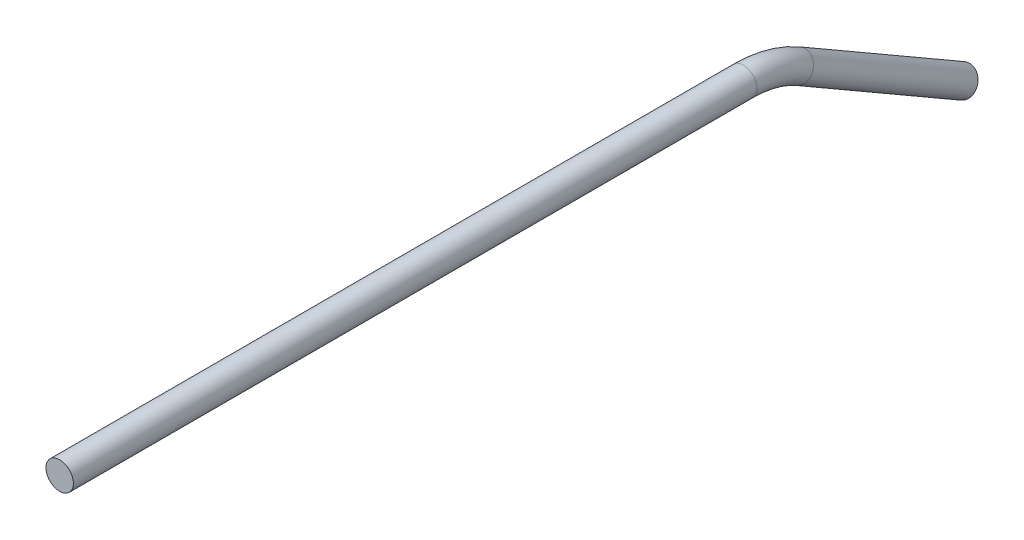
ISO-10303-21;
HEADER;
FILE_DESCRIPTION(('STEP AP214'),'2;1');
FILE_NAME('part.step','',(''),(''),'','','');
FILE_SCHEMA(('AUTOMOTIVE_DESIGN { 1 0 10303 214 1 1 1 1 }'));
ENDSEC;
DATA;
#1=APPLICATION_CONTEXT('core data for automotive mechanical design processes');
#2=APPLICATION_PROTOCOL_DEFINITION('international standard','automotive_design',2000,#1);
#3=PRODUCT_CONTEXT('',#1,'mechanical');
#4=PRODUCT('Part','Part','',(#3));
#5=PRODUCT_RELATED_PRODUCT_CATEGORY('part','',(#4));
#6=PRODUCT_DEFINITION_FORMATION('','',#4);
#7=PRODUCT_DEFINITION_CONTEXT('part definition',#1,'design');
#8=PRODUCT_DEFINITION('design','',#6,#7);
#9=PRODUCT_DEFINITION_SHAPE('','',#8);
#10=(LENGTH_UNIT() NAMED_UNIT(*) SI_UNIT(.MILLI.,.METRE.));
#11=(NAMED_UNIT(*) PLANE_ANGLE_UNIT() SI_UNIT($,.RADIAN.));
#12=(NAMED_UNIT(*) SI_UNIT($,.STERADIAN.) SOLID_ANGLE_UNIT());
#13=UNCERTAINTY_MEASURE_WITH_UNIT(LENGTH_MEASURE(1.E-05),#10,'distance_accuracy_value','');
#14=(GEOMETRIC_REPRESENTATION_CONTEXT(3) GLOBAL_UNCERTAINTY_ASSIGNED_CONTEXT((#13)) GLOBAL_UNIT_ASSIGNED_CONTEXT((#10,
#11,#12)) REPRESENTATION_CONTEXT('',''));
#15=CARTESIAN_POINT('',(0.,0.,0.));
#16=DIRECTION('',(0.,0.,1.));
#17=DIRECTION('',(1.,0.,0.));
#18=AXIS2_PLACEMENT_3D('',#15,#16,#17);
#19=CARTESIAN_POINT('',(0.,-3.40295474387528,-170.994090512249));
#20=DIRECTION('',(0.,-0.500000000000001,-0.866025403784438));
#21=DIRECTION('',(0.,0.866025403784438,-0.500000000000001));
#22=AXIS2_PLACEMENT_3D('',#19,#20,#21);
#23=CYLINDRICAL_SURFACE('',#22,3.175);
#24=CARTESIAN_POINT('',(0.,-3.40295474387528,-170.994090512249));
#25=DIRECTION('',(0.,0.500000000000002,0.866025403784438));
#26=DIRECTION('',(1.,0.,0.));
#27=AXIS2_PLACEMENT_3D('',#24,#25,#26);
#28=CIRCLE('',#27,3.175);
#29=CARTESIAN_POINT('',(0.,-0.653324086859693,-172.58159051225));
#30=VERTEX_POINT('',#29);
#31=EDGE_CURVE('E37',#30,#30,#28,.T.);
#32=ORIENTED_EDGE('',*,*,#31,.F.);
#33=EDGE_LOOP('',(#32));
#34=FACE_BOUND('',#33,.T.);
#35=CARTESIAN_POINT('',(0.,-25.4,-209.094090512249));
#36=DIRECTION('',(0.,0.500000000000002,0.866025403784438));
#37=DIRECTION('',(1.,0.,0.));
#38=AXIS2_PLACEMENT_3D('',#35,#36,#37);
#39=CIRCLE('',#38,3.175);
#40=CARTESIAN_POINT('',(3.175,-25.4,-209.094090512249));
#41=VERTEX_POINT('',#40);
#42=EDGE_CURVE('E10',#41,#41,#39,.T.);
#43=ORIENTED_EDGE('',*,*,#42,.T.);
#44=EDGE_LOOP('',(#43));
#45=FACE_BOUND('',#44,.T.);
#46=ADVANCED_FACE('F31',(#34,#45),#23,.T.);
#47=CARTESIAN_POINT('',(0.,-25.4,-158.294090512249));
#48=DIRECTION('',(-1.,0.,0.));
#49=DIRECTION('',(0.,0.,1.));
#50=AXIS2_PLACEMENT_3D('',#47,#48,#49);
#51=TOROIDAL_SURFACE('',#50,25.4,3.175);
#52=CARTESIAN_POINT('',(0.,0.,-158.294090512249));
#53=DIRECTION('',(0.,0.,1.));
#54=DIRECTION('',(1.,0.,0.));
#55=AXIS2_PLACEMENT_3D('',#52,#53,#54);
#56=CIRCLE('',#55,3.175);
#57=CARTESIAN_POINT('',(0.,3.175,-158.294090512249));
#58=VERTEX_POINT('',#57);
#59=EDGE_CURVE('E41',#58,#58,#56,.T.);
#60=CARTESIAN_POINT('',(0.,-25.4,-158.294090512249));
#61=DIRECTION('',(-1.,0.,0.));
#62=DIRECTION('',(0.,0.,1.));
#63=AXIS2_PLACEMENT_3D('',#60,#61,#62);
#64=CIRCLE('',#63,28.575);
#65=EDGE_CURVE('',#58,#30,#64,.T.);
#66=ORIENTED_EDGE('',*,*,#59,.F.);
#67=ORIENTED_EDGE('',*,*,#31,.T.);
#68=ORIENTED_EDGE('',*,*,#65,.T.);
#69=ORIENTED_EDGE('',*,*,#65,.F.);
#70=EDGE_LOOP('',(#66,#68,#67,#69));
#71=FACE_BOUND('',#70,.T.);
#72=ADVANCED_FACE('F56',(#71),#51,.T.);
#73=CARTESIAN_POINT('',(0.,0.,-158.294090512249));
#74=DIRECTION('',(0.,0.,1.));
#75=DIRECTION('',(1.,0.,0.));
#76=AXIS2_PLACEMENT_3D('',#73,#74,#75);
#77=CYLINDRICAL_SURFACE('',#76,3.175);
#78=ORIENTED_EDGE('',*,*,#59,.T.);
#79=EDGE_LOOP('',(#78));
#80=FACE_BOUND('',#79,.T.);
#81=CARTESIAN_POINT('',(0.,0.,0.));
#82=DIRECTION('',(0.,0.,1.));
#83=DIRECTION('',(1.,0.,0.));
#84=AXIS2_PLACEMENT_3D('',#81,#82,#83);
#85=CIRCLE('',#84,3.175);
#86=CARTESIAN_POINT('',(3.175,0.,0.));
#87=VERTEX_POINT('',#86);
#88=EDGE_CURVE('E45',#87,#87,#85,.T.);
#89=ORIENTED_EDGE('',*,*,#88,.F.);
#90=EDGE_LOOP('',(#89));
#91=FACE_BOUND('',#90,.T.);
#92=ADVANCED_FACE('F53',(#80,#91),#77,.T.);
#93=CARTESIAN_POINT('',(0.,-25.4,-209.094090512249));
#94=DIRECTION('',(0.,0.500000000000002,0.866025403784438));
#95=DIRECTION('',(1.,0.,0.));
#96=AXIS2_PLACEMENT_3D('',#93,#94,#95);
#97=PLANE('',#96);
#98=ORIENTED_EDGE('',*,*,#42,.F.);
#99=EDGE_LOOP('',(#98));
#100=FACE_BOUND('',#99,.T.);
#101=ADVANCED_FACE('F55',(#100),#97,.F.);
#102=CARTESIAN_POINT('',(0.,0.,0.));
#103=DIRECTION('',(0.,0.,1.));
#104=DIRECTION('',(1.,0.,0.));
#105=AXIS2_PLACEMENT_3D('',#102,#103,#104);
#106=PLANE('',#105);
#107=ORIENTED_EDGE('',*,*,#88,.T.);
#108=EDGE_LOOP('',(#107));
#109=FACE_BOUND('',#108,.T.);
#110=ADVANCED_FACE('F51',(#109),#106,.T.);
#111=CLOSED_SHELL('',(#46,#72,#92,#101,#110));
#112=MANIFOLD_SOLID_BREP('B2',#111);
#113=ADVANCED_BREP_SHAPE_REPRESENTATION('',(#18,#112),#14);
#114=SHAPE_DEFINITION_REPRESENTATION(#9,#113);
ENDSEC;
END-ISO-10303-21;
